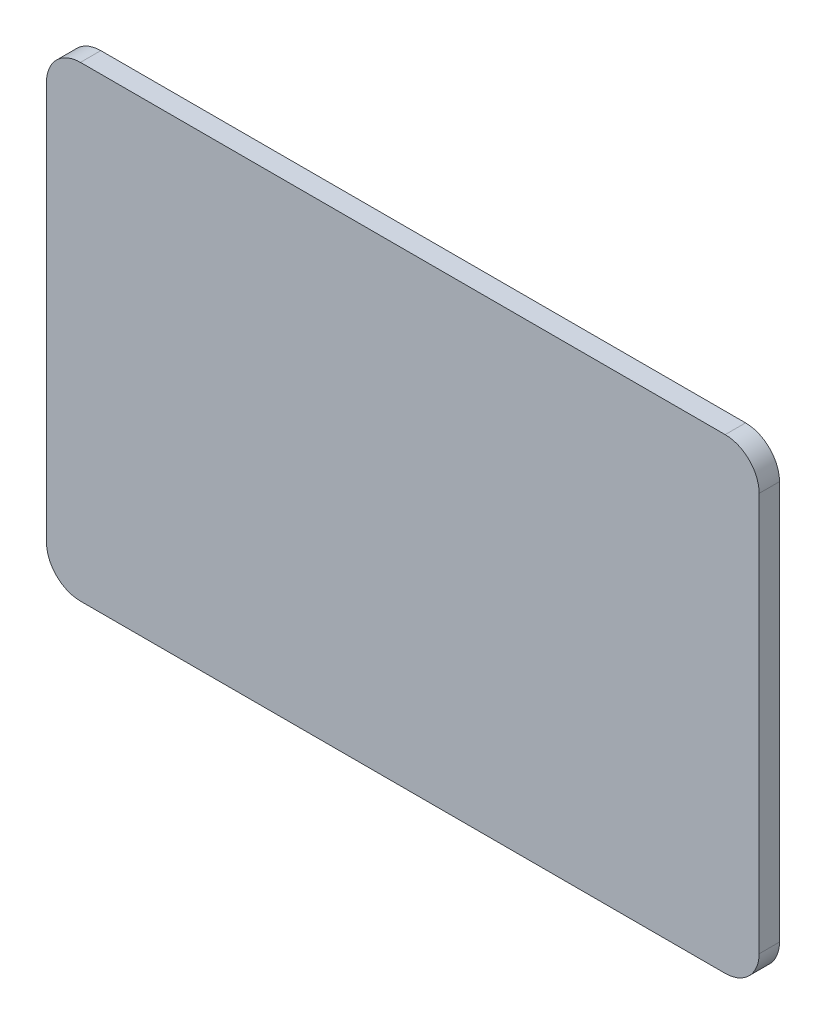
ISO-10303-21;
HEADER;
FILE_DESCRIPTION(('STEP AP214'),'2;1');
FILE_NAME('part.step','',(''),(''),'','','');
FILE_SCHEMA(('AUTOMOTIVE_DESIGN { 1 0 10303 214 1 1 1 1 }'));
ENDSEC;
DATA;
#1=APPLICATION_CONTEXT('core data for automotive mechanical design processes');
#2=APPLICATION_PROTOCOL_DEFINITION('international standard','automotive_design',2000,#1);
#3=PRODUCT_CONTEXT('',#1,'mechanical');
#4=PRODUCT('Part','Part','',(#3));
#5=PRODUCT_RELATED_PRODUCT_CATEGORY('part','',(#4));
#6=PRODUCT_DEFINITION_FORMATION('','',#4);
#7=PRODUCT_DEFINITION_CONTEXT('part definition',#1,'design');
#8=PRODUCT_DEFINITION('design','',#6,#7);
#9=PRODUCT_DEFINITION_SHAPE('','',#8);
#10=(LENGTH_UNIT() NAMED_UNIT(*) SI_UNIT(.MILLI.,.METRE.));
#11=(NAMED_UNIT(*) PLANE_ANGLE_UNIT() SI_UNIT($,.RADIAN.));
#12=(NAMED_UNIT(*) SI_UNIT($,.STERADIAN.) SOLID_ANGLE_UNIT());
#13=UNCERTAINTY_MEASURE_WITH_UNIT(LENGTH_MEASURE(1.E-05),#10,'distance_accuracy_value','');
#14=(GEOMETRIC_REPRESENTATION_CONTEXT(3) GLOBAL_UNCERTAINTY_ASSIGNED_CONTEXT((#13)) GLOBAL_UNIT_ASSIGNED_CONTEXT((#10,
#11,#12)) REPRESENTATION_CONTEXT('',''));
#15=CARTESIAN_POINT('',(0.,0.,0.));
#16=DIRECTION('',(0.,0.,1.));
#17=DIRECTION('',(1.,0.,0.));
#18=AXIS2_PLACEMENT_3D('',#15,#16,#17);
#19=CARTESIAN_POINT('',(-47.5,-29.375,3.));
#20=DIRECTION('',(0.,0.,-1.));
#21=DIRECTION('',(-1.,0.,0.));
#22=AXIS2_PLACEMENT_3D('',#19,#20,#21);
#23=CYLINDRICAL_SURFACE('',#22,5.);
#24=CARTESIAN_POINT('',(-47.5,-29.375,0.));
#25=DIRECTION('',(0.,0.,1.));
#26=DIRECTION('',(-1.,0.,0.));
#27=AXIS2_PLACEMENT_3D('',#24,#25,#26);
#28=CIRCLE('',#27,5.);
#29=CARTESIAN_POINT('',(-52.5,-29.375,0.));
#30=VERTEX_POINT('',#29);
#31=CARTESIAN_POINT('',(-47.5,-34.375,0.));
#32=VERTEX_POINT('',#31);
#33=EDGE_CURVE('E140',#30,#32,#28,.T.);
#34=ORIENTED_EDGE('',*,*,#33,.T.);
#35=DIRECTION('',(0.,0.,-1.));
#36=VECTOR('',#35,1.);
#37=CARTESIAN_POINT('',(-47.5,-34.375,3.));
#38=LINE('',#37,#36);
#39=CARTESIAN_POINT('',(-47.5,-34.375,3.));
#40=VERTEX_POINT('',#39);
#41=EDGE_CURVE('E11',#40,#32,#38,.T.);
#42=ORIENTED_EDGE('',*,*,#41,.F.);
#43=CARTESIAN_POINT('',(-47.5,-29.375,3.));
#44=DIRECTION('',(0.,0.,1.));
#45=DIRECTION('',(-1.,0.,0.));
#46=AXIS2_PLACEMENT_3D('',#43,#44,#45);
#47=CIRCLE('',#46,5.);
#48=CARTESIAN_POINT('',(-52.5,-29.375,3.));
#49=VERTEX_POINT('',#48);
#50=EDGE_CURVE('E162',#49,#40,#47,.T.);
#51=ORIENTED_EDGE('',*,*,#50,.F.);
#52=DIRECTION('',(0.,0.,-1.));
#53=VECTOR('',#52,1.);
#54=CARTESIAN_POINT('',(-52.5,-29.375,3.));
#55=LINE('',#54,#53);
#56=EDGE_CURVE('E136',#49,#30,#55,.T.);
#57=ORIENTED_EDGE('',*,*,#56,.T.);
#58=EDGE_LOOP('',(#34,#42,#51,#57));
#59=FACE_BOUND('',#58,.T.);
#60=ADVANCED_FACE('F39',(#59),#23,.T.);
#61=CARTESIAN_POINT('',(47.5,-34.375,3.));
#62=DIRECTION('',(0.,1.,0.));
#63=DIRECTION('',(-1.,0.,0.));
#64=AXIS2_PLACEMENT_3D('',#61,#62,#63);
#65=PLANE('',#64);
#66=DIRECTION('',(1.,0.,0.));
#67=VECTOR('',#66,1.);
#68=CARTESIAN_POINT('',(47.5,-34.375,0.));
#69=LINE('',#68,#67);
#70=CARTESIAN_POINT('',(47.5,-34.375,0.));
#71=VERTEX_POINT('',#70);
#72=EDGE_CURVE('E144',#32,#71,#69,.T.);
#73=ORIENTED_EDGE('',*,*,#72,.T.);
#74=DIRECTION('',(0.,0.,-1.));
#75=VECTOR('',#74,1.);
#76=CARTESIAN_POINT('',(47.5,-34.375,3.));
#77=LINE('',#76,#75);
#78=CARTESIAN_POINT('',(47.5,-34.375,3.));
#79=VERTEX_POINT('',#78);
#80=EDGE_CURVE('E48',#79,#71,#77,.T.);
#81=ORIENTED_EDGE('',*,*,#80,.F.);
#82=DIRECTION('',(1.,0.,0.));
#83=VECTOR('',#82,1.);
#84=CARTESIAN_POINT('',(47.5,-34.375,3.));
#85=LINE('',#84,#83);
#86=EDGE_CURVE('E99',#40,#79,#85,.T.);
#87=ORIENTED_EDGE('',*,*,#86,.F.);
#88=ORIENTED_EDGE('',*,*,#41,.T.);
#89=EDGE_LOOP('',(#73,#81,#87,#88));
#90=FACE_BOUND('',#89,.T.);
#91=ADVANCED_FACE('F208',(#90),#65,.F.);
#92=CARTESIAN_POINT('',(47.5,-29.375,3.));
#93=DIRECTION('',(0.,0.,-1.));
#94=DIRECTION('',(-1.,0.,0.));
#95=AXIS2_PLACEMENT_3D('',#92,#93,#94);
#96=CYLINDRICAL_SURFACE('',#95,5.);
#97=CARTESIAN_POINT('',(47.5,-29.375,0.));
#98=DIRECTION('',(0.,0.,1.));
#99=DIRECTION('',(1.,0.,0.));
#100=AXIS2_PLACEMENT_3D('',#97,#98,#99);
#101=CIRCLE('',#100,5.);
#102=CARTESIAN_POINT('',(52.5,-29.375,0.));
#103=VERTEX_POINT('',#102);
#104=EDGE_CURVE('E147',#71,#103,#101,.T.);
#105=ORIENTED_EDGE('',*,*,#104,.T.);
#106=DIRECTION('',(0.,0.,-1.));
#107=VECTOR('',#106,1.);
#108=CARTESIAN_POINT('',(52.5,-29.375,3.));
#109=LINE('',#108,#107);
#110=CARTESIAN_POINT('',(52.5,-29.375,3.));
#111=VERTEX_POINT('',#110);
#112=EDGE_CURVE('E173',#111,#103,#109,.T.);
#113=ORIENTED_EDGE('',*,*,#112,.F.);
#114=CARTESIAN_POINT('',(47.5,-29.375,3.));
#115=DIRECTION('',(0.,0.,1.));
#116=DIRECTION('',(1.,0.,0.));
#117=AXIS2_PLACEMENT_3D('',#114,#115,#116);
#118=CIRCLE('',#117,5.);
#119=EDGE_CURVE('E183',#79,#111,#118,.T.);
#120=ORIENTED_EDGE('',*,*,#119,.F.);
#121=ORIENTED_EDGE('',*,*,#80,.T.);
#122=EDGE_LOOP('',(#105,#113,#120,#121));
#123=FACE_BOUND('',#122,.T.);
#124=ADVANCED_FACE('F181',(#123),#96,.T.);
#125=CARTESIAN_POINT('',(52.5,-29.375,3.));
#126=DIRECTION('',(-1.,0.,0.));
#127=DIRECTION('',(0.,0.,1.));
#128=AXIS2_PLACEMENT_3D('',#125,#126,#127);
#129=PLANE('',#128);
#130=DIRECTION('',(0.,1.,0.));
#131=VECTOR('',#130,1.);
#132=CARTESIAN_POINT('',(52.5,-29.375,0.));
#133=LINE('',#132,#131);
#134=CARTESIAN_POINT('',(52.5,29.375,0.));
#135=VERTEX_POINT('',#134);
#136=EDGE_CURVE('E150',#103,#135,#133,.T.);
#137=ORIENTED_EDGE('',*,*,#136,.T.);
#138=DIRECTION('',(0.,0.,-1.));
#139=VECTOR('',#138,1.);
#140=CARTESIAN_POINT('',(52.5,29.375,3.));
#141=LINE('',#140,#139);
#142=CARTESIAN_POINT('',(52.5,29.375,3.));
#143=VERTEX_POINT('',#142);
#144=EDGE_CURVE('E169',#143,#135,#141,.T.);
#145=ORIENTED_EDGE('',*,*,#144,.F.);
#146=DIRECTION('',(0.,1.,0.));
#147=VECTOR('',#146,1.);
#148=CARTESIAN_POINT('',(52.5,-29.375,3.));
#149=LINE('',#148,#147);
#150=EDGE_CURVE('E196',#111,#143,#149,.T.);
#151=ORIENTED_EDGE('',*,*,#150,.F.);
#152=ORIENTED_EDGE('',*,*,#112,.T.);
#153=EDGE_LOOP('',(#137,#145,#151,#152));
#154=FACE_BOUND('',#153,.T.);
#155=ADVANCED_FACE('F191',(#154),#129,.F.);
#156=CARTESIAN_POINT('',(47.5,29.375,3.));
#157=DIRECTION('',(0.,0.,-1.));
#158=DIRECTION('',(-1.,0.,0.));
#159=AXIS2_PLACEMENT_3D('',#156,#157,#158);
#160=CYLINDRICAL_SURFACE('',#159,5.);
#161=CARTESIAN_POINT('',(47.5,29.375,0.));
#162=DIRECTION('',(0.,0.,1.));
#163=DIRECTION('',(1.,0.,0.));
#164=AXIS2_PLACEMENT_3D('',#161,#162,#163);
#165=CIRCLE('',#164,5.);
#166=CARTESIAN_POINT('',(47.5,34.375,0.));
#167=VERTEX_POINT('',#166);
#168=EDGE_CURVE('E153',#135,#167,#165,.T.);
#169=ORIENTED_EDGE('',*,*,#168,.T.);
#170=DIRECTION('',(0.,0.,-1.));
#171=VECTOR('',#170,1.);
#172=CARTESIAN_POINT('',(47.5,34.375,3.));
#173=LINE('',#172,#171);
#174=CARTESIAN_POINT('',(47.5,34.375,3.));
#175=VERTEX_POINT('',#174);
#176=EDGE_CURVE('E129',#175,#167,#173,.T.);
#177=ORIENTED_EDGE('',*,*,#176,.F.);
#178=CARTESIAN_POINT('',(47.5,29.375,3.));
#179=DIRECTION('',(0.,0.,1.));
#180=DIRECTION('',(1.,0.,0.));
#181=AXIS2_PLACEMENT_3D('',#178,#179,#180);
#182=CIRCLE('',#181,5.);
#183=EDGE_CURVE('E118',#143,#175,#182,.T.);
#184=ORIENTED_EDGE('',*,*,#183,.F.);
#185=ORIENTED_EDGE('',*,*,#144,.T.);
#186=EDGE_LOOP('',(#169,#177,#184,#185));
#187=FACE_BOUND('',#186,.T.);
#188=ADVANCED_FACE('F194',(#187),#160,.T.);
#189=CARTESIAN_POINT('',(47.5,34.375,3.));
#190=DIRECTION('',(0.,-1.,0.));
#191=DIRECTION('',(1.,0.,0.));
#192=AXIS2_PLACEMENT_3D('',#189,#190,#191);
#193=PLANE('',#192);
#194=DIRECTION('',(-1.,0.,0.));
#195=VECTOR('',#194,1.);
#196=CARTESIAN_POINT('',(47.5,34.375,0.));
#197=LINE('',#196,#195);
#198=CARTESIAN_POINT('',(-47.5,34.375,0.));
#199=VERTEX_POINT('',#198);
#200=EDGE_CURVE('E127',#167,#199,#197,.T.);
#201=ORIENTED_EDGE('',*,*,#200,.T.);
#202=DIRECTION('',(0.,0.,-1.));
#203=VECTOR('',#202,1.);
#204=CARTESIAN_POINT('',(-47.5,34.375,3.));
#205=LINE('',#204,#203);
#206=CARTESIAN_POINT('',(-47.5,34.375,3.));
#207=VERTEX_POINT('',#206);
#208=EDGE_CURVE('E124',#207,#199,#205,.T.);
#209=ORIENTED_EDGE('',*,*,#208,.F.);
#210=DIRECTION('',(-1.,0.,0.));
#211=VECTOR('',#210,1.);
#212=CARTESIAN_POINT('',(47.5,34.375,3.));
#213=LINE('',#212,#211);
#214=EDGE_CURVE('E112',#175,#207,#213,.T.);
#215=ORIENTED_EDGE('',*,*,#214,.F.);
#216=ORIENTED_EDGE('',*,*,#176,.T.);
#217=EDGE_LOOP('',(#201,#209,#215,#216));
#218=FACE_BOUND('',#217,.T.);
#219=ADVANCED_FACE('F125',(#218),#193,.F.);
#220=CARTESIAN_POINT('',(-47.5,29.375,3.));
#221=DIRECTION('',(0.,0.,-1.));
#222=DIRECTION('',(-1.,0.,0.));
#223=AXIS2_PLACEMENT_3D('',#220,#221,#222);
#224=CYLINDRICAL_SURFACE('',#223,5.);
#225=CARTESIAN_POINT('',(-47.5,29.375,0.));
#226=DIRECTION('',(0.,0.,1.));
#227=DIRECTION('',(1.,0.,0.));
#228=AXIS2_PLACEMENT_3D('',#225,#226,#227);
#229=CIRCLE('',#228,5.);
#230=CARTESIAN_POINT('',(-52.5,29.375,0.));
#231=VERTEX_POINT('',#230);
#232=EDGE_CURVE('E85',#199,#231,#229,.T.);
#233=ORIENTED_EDGE('',*,*,#232,.T.);
#234=DIRECTION('',(0.,0.,-1.));
#235=VECTOR('',#234,1.);
#236=CARTESIAN_POINT('',(-52.5,29.375,3.));
#237=LINE('',#236,#235);
#238=CARTESIAN_POINT('',(-52.5,29.375,3.));
#239=VERTEX_POINT('',#238);
#240=EDGE_CURVE('E130',#239,#231,#237,.T.);
#241=ORIENTED_EDGE('',*,*,#240,.F.);
#242=CARTESIAN_POINT('',(-47.5,29.375,3.));
#243=DIRECTION('',(0.,0.,1.));
#244=DIRECTION('',(1.,0.,0.));
#245=AXIS2_PLACEMENT_3D('',#242,#243,#244);
#246=CIRCLE('',#245,5.);
#247=EDGE_CURVE('E116',#207,#239,#246,.T.);
#248=ORIENTED_EDGE('',*,*,#247,.F.);
#249=ORIENTED_EDGE('',*,*,#208,.T.);
#250=EDGE_LOOP('',(#233,#241,#248,#249));
#251=FACE_BOUND('',#250,.T.);
#252=ADVANCED_FACE('F132',(#251),#224,.T.);
#253=CARTESIAN_POINT('',(-52.5,-29.375,3.));
#254=DIRECTION('',(1.,0.,0.));
#255=DIRECTION('',(0.,0.,-1.));
#256=AXIS2_PLACEMENT_3D('',#253,#254,#255);
#257=PLANE('',#256);
#258=DIRECTION('',(0.,-1.,0.));
#259=VECTOR('',#258,1.);
#260=CARTESIAN_POINT('',(-52.5,-29.375,0.));
#261=LINE('',#260,#259);
#262=EDGE_CURVE('E91',#231,#30,#261,.T.);
#263=ORIENTED_EDGE('',*,*,#262,.T.);
#264=ORIENTED_EDGE('',*,*,#56,.F.);
#265=DIRECTION('',(0.,-1.,0.));
#266=VECTOR('',#265,1.);
#267=CARTESIAN_POINT('',(-52.5,-29.375,3.));
#268=LINE('',#267,#266);
#269=EDGE_CURVE('E56',#239,#49,#268,.T.);
#270=ORIENTED_EDGE('',*,*,#269,.F.);
#271=ORIENTED_EDGE('',*,*,#240,.T.);
#272=EDGE_LOOP('',(#263,#264,#270,#271));
#273=FACE_BOUND('',#272,.T.);
#274=ADVANCED_FACE('F224',(#273),#257,.F.);
#275=CARTESIAN_POINT('',(-47.5,-29.375,3.));
#276=DIRECTION('',(0.,0.,-1.));
#277=DIRECTION('',(-1.,0.,0.));
#278=AXIS2_PLACEMENT_3D('',#275,#276,#277);
#279=PLANE('',#278);
#280=ORIENTED_EDGE('',*,*,#50,.T.);
#281=ORIENTED_EDGE('',*,*,#86,.T.);
#282=ORIENTED_EDGE('',*,*,#119,.T.);
#283=ORIENTED_EDGE('',*,*,#150,.T.);
#284=ORIENTED_EDGE('',*,*,#183,.T.);
#285=ORIENTED_EDGE('',*,*,#214,.T.);
#286=ORIENTED_EDGE('',*,*,#247,.T.);
#287=ORIENTED_EDGE('',*,*,#269,.T.);
#288=EDGE_LOOP('',(#280,#281,#282,#283,#284,#285,#286,#287));
#289=FACE_BOUND('',#288,.T.);
#290=ADVANCED_FACE('F114',(#289),#279,.F.);
#291=CARTESIAN_POINT('',(-47.5,-29.375,0.));
#292=DIRECTION('',(0.,0.,-1.));
#293=DIRECTION('',(-1.,0.,0.));
#294=AXIS2_PLACEMENT_3D('',#291,#292,#293);
#295=PLANE('',#294);
#296=ORIENTED_EDGE('',*,*,#33,.F.);
#297=ORIENTED_EDGE('',*,*,#262,.F.);
#298=ORIENTED_EDGE('',*,*,#232,.F.);
#299=ORIENTED_EDGE('',*,*,#200,.F.);
#300=ORIENTED_EDGE('',*,*,#168,.F.);
#301=ORIENTED_EDGE('',*,*,#136,.F.);
#302=ORIENTED_EDGE('',*,*,#104,.F.);
#303=ORIENTED_EDGE('',*,*,#72,.F.);
#304=EDGE_LOOP('',(#296,#297,#298,#299,#300,#301,#302,#303));
#305=FACE_BOUND('',#304,.T.);
#306=ADVANCED_FACE('F187',(#305),#295,.T.);
#307=CLOSED_SHELL('',(#60,#91,#124,#155,#188,#219,#252,#274,#290,#306));
#308=MANIFOLD_SOLID_BREP('B2',#307);
#309=ADVANCED_BREP_SHAPE_REPRESENTATION('',(#18,#308),#14);
#310=SHAPE_DEFINITION_REPRESENTATION(#9,#309);
ENDSEC;
END-ISO-10303-21;
